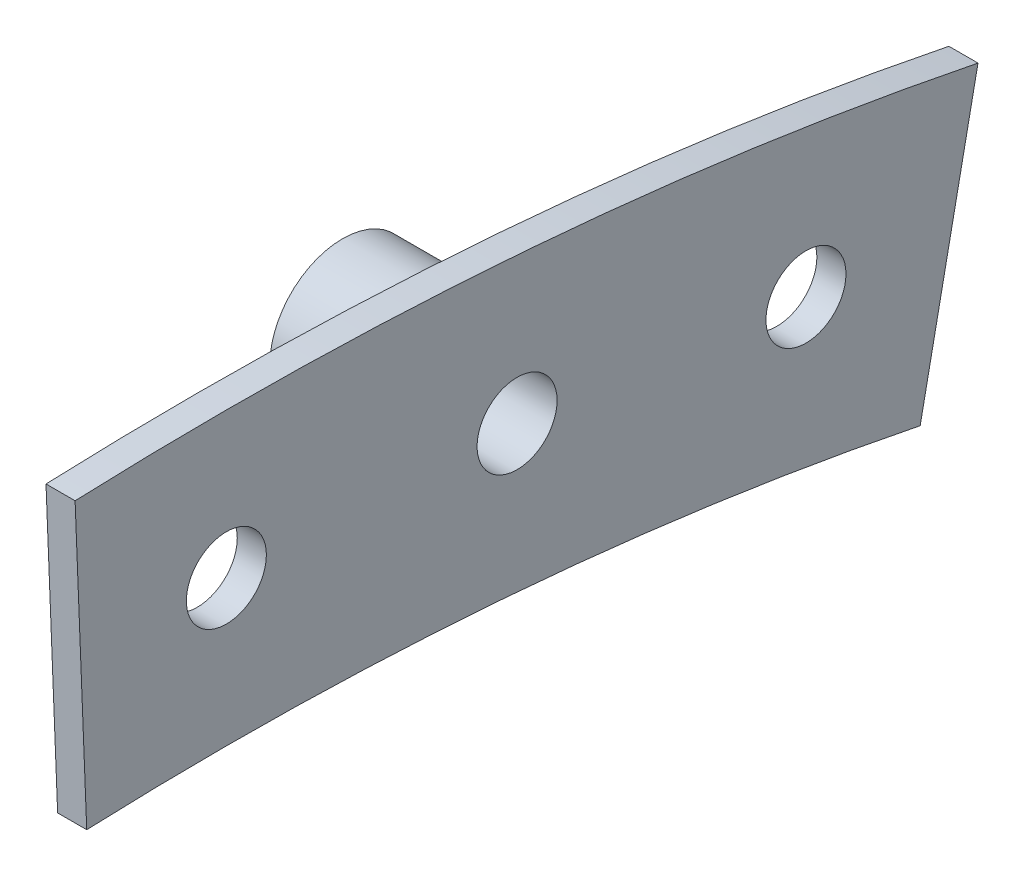
ISO-10303-21;
HEADER;
FILE_DESCRIPTION(('STEP AP214'),'2;1');
FILE_NAME('part.step','',(''),(''),'','','');
FILE_SCHEMA(('AUTOMOTIVE_DESIGN { 1 0 10303 214 1 1 1 1 }'));
ENDSEC;
DATA;
#1=APPLICATION_CONTEXT('core data for automotive mechanical design processes');
#2=APPLICATION_PROTOCOL_DEFINITION('international standard','automotive_design',2000,#1);
#3=PRODUCT_CONTEXT('',#1,'mechanical');
#4=PRODUCT('Part','Part','',(#3));
#5=PRODUCT_RELATED_PRODUCT_CATEGORY('part','',(#4));
#6=PRODUCT_DEFINITION_FORMATION('','',#4);
#7=PRODUCT_DEFINITION_CONTEXT('part definition',#1,'design');
#8=PRODUCT_DEFINITION('design','',#6,#7);
#9=PRODUCT_DEFINITION_SHAPE('','',#8);
#10=(LENGTH_UNIT() NAMED_UNIT(*) SI_UNIT(.MILLI.,.METRE.));
#11=(NAMED_UNIT(*) PLANE_ANGLE_UNIT() SI_UNIT($,.RADIAN.));
#12=(NAMED_UNIT(*) SI_UNIT($,.STERADIAN.) SOLID_ANGLE_UNIT());
#13=UNCERTAINTY_MEASURE_WITH_UNIT(LENGTH_MEASURE(1.E-05),#10,'distance_accuracy_value','');
#14=(GEOMETRIC_REPRESENTATION_CONTEXT(3) GLOBAL_UNCERTAINTY_ASSIGNED_CONTEXT((#13)) GLOBAL_UNIT_ASSIGNED_CONTEXT((#10,
#11,#12)) REPRESENTATION_CONTEXT('',''));
#15=CARTESIAN_POINT('',(0.,0.,0.));
#16=DIRECTION('',(0.,0.,1.));
#17=DIRECTION('',(1.,0.,0.));
#18=AXIS2_PLACEMENT_3D('',#15,#16,#17);
#19=CARTESIAN_POINT('',(2.54,0.,0.));
#20=DIRECTION('',(-1.,0.,0.));
#21=DIRECTION('',(0.,0.,1.));
#22=AXIS2_PLACEMENT_3D('',#19,#20,#21);
#23=CYLINDRICAL_SURFACE('',#22,330.2);
#24=CARTESIAN_POINT('',(0.,0.,0.));
#25=DIRECTION('',(1.,0.,0.));
#26=DIRECTION('',(0.,0.,-1.));
#27=AXIS2_PLACEMENT_3D('',#24,#25,#26);
#28=CIRCLE('',#27,330.2);
#29=CARTESIAN_POINT('',(0.,329.93584,13.2053581357871));
#30=VERTEX_POINT('',#29);
#31=CARTESIAN_POINT('',(0.,323.61500772706,-65.6152937493609));
#32=VERTEX_POINT('',#31);
#33=EDGE_CURVE('E129',#30,#32,#28,.F.);
#34=ORIENTED_EDGE('',*,*,#33,.F.);
#35=DIRECTION('',(-1.,0.,0.));
#36=VECTOR('',#35,1.);
#37=CARTESIAN_POINT('',(2.54,329.93584,13.2053581357871));
#38=LINE('',#37,#36);
#39=CARTESIAN_POINT('',(2.54,329.93584,13.2053581357871));
#40=VERTEX_POINT('',#39);
#41=EDGE_CURVE('E53',#40,#30,#38,.T.);
#42=ORIENTED_EDGE('',*,*,#41,.F.);
#43=CARTESIAN_POINT('',(2.54,0.,0.));
#44=DIRECTION('',(1.,0.,0.));
#45=DIRECTION('',(0.,0.,-1.));
#46=AXIS2_PLACEMENT_3D('',#43,#44,#45);
#47=CIRCLE('',#46,330.2);
#48=CARTESIAN_POINT('',(2.54,323.61500772706,-65.6152937493609));
#49=VERTEX_POINT('',#48);
#50=EDGE_CURVE('E111',#40,#49,#47,.F.);
#51=ORIENTED_EDGE('',*,*,#50,.T.);
#52=DIRECTION('',(-1.,0.,0.));
#53=VECTOR('',#52,1.);
#54=CARTESIAN_POINT('',(2.54,323.61500772706,-65.6152937493609));
#55=LINE('',#54,#53);
#56=EDGE_CURVE('E85',#49,#32,#55,.T.);
#57=ORIENTED_EDGE('',*,*,#56,.T.);
#58=EDGE_LOOP('',(#34,#42,#51,#57));
#59=FACE_BOUND('',#58,.T.);
#60=ADVANCED_FACE('F43',(#59),#23,.T.);
#61=CARTESIAN_POINT('',(2.54,0.,0.));
#62=DIRECTION('',(0.,-0.0399919991998399,0.9992));
#63=DIRECTION('',(0.,-0.9992,-0.0399919991998399));
#64=AXIS2_PLACEMENT_3D('',#61,#62,#63);
#65=PLANE('',#64);
#66=DIRECTION('',(0.,0.9992,0.0399919991998399));
#67=VECTOR('',#66,1.);
#68=CARTESIAN_POINT('',(0.,0.,0.));
#69=LINE('',#68,#67);
#70=CARTESIAN_POINT('',(0.,304.55616,12.1895613561112));
#71=VERTEX_POINT('',#70);
#72=EDGE_CURVE('E98',#71,#30,#69,.T.);
#73=ORIENTED_EDGE('',*,*,#72,.F.);
#74=DIRECTION('',(-1.,0.,0.));
#75=VECTOR('',#74,1.);
#76=CARTESIAN_POINT('',(2.54,304.55616,12.1895613561112));
#77=LINE('',#76,#75);
#78=CARTESIAN_POINT('',(2.54,304.55616,12.1895613561112));
#79=VERTEX_POINT('',#78);
#80=EDGE_CURVE('E92',#79,#71,#77,.T.);
#81=ORIENTED_EDGE('',*,*,#80,.F.);
#82=DIRECTION('',(0.,0.9992,0.0399919991998399));
#83=VECTOR('',#82,1.);
#84=CARTESIAN_POINT('',(2.54,0.,0.));
#85=LINE('',#84,#83);
#86=EDGE_CURVE('E96',#79,#40,#85,.T.);
#87=ORIENTED_EDGE('',*,*,#86,.T.);
#88=ORIENTED_EDGE('',*,*,#41,.T.);
#89=EDGE_LOOP('',(#73,#81,#87,#88));
#90=FACE_BOUND('',#89,.T.);
#91=ADVANCED_FACE('F94',(#90),#65,.T.);
#92=CARTESIAN_POINT('',(2.54,0.,0.));
#93=DIRECTION('',(-1.,0.,0.));
#94=DIRECTION('',(0.,0.,1.));
#95=AXIS2_PLACEMENT_3D('',#92,#93,#94);
#96=CYLINDRICAL_SURFACE('',#95,304.8);
#97=CARTESIAN_POINT('',(0.,0.,0.));
#98=DIRECTION('',(1.,0.,0.));
#99=DIRECTION('',(0.,0.,-1.));
#100=AXIS2_PLACEMENT_3D('',#97,#98,#99);
#101=CIRCLE('',#100,304.8);
#102=CARTESIAN_POINT('',(0.,298.721545594209,-60.5679634609485));
#103=VERTEX_POINT('',#102);
#104=EDGE_CURVE('E135',#71,#103,#101,.F.);
#105=ORIENTED_EDGE('',*,*,#104,.T.);
#106=DIRECTION('',(-1.,0.,0.));
#107=VECTOR('',#106,1.);
#108=CARTESIAN_POINT('',(2.54,298.721545594209,-60.5679634609485));
#109=LINE('',#108,#107);
#110=CARTESIAN_POINT('',(2.54,298.721545594209,-60.5679634609485));
#111=VERTEX_POINT('',#110);
#112=EDGE_CURVE('E102',#111,#103,#109,.T.);
#113=ORIENTED_EDGE('',*,*,#112,.F.);
#114=CARTESIAN_POINT('',(2.54,0.,0.));
#115=DIRECTION('',(1.,0.,0.));
#116=DIRECTION('',(0.,0.,-1.));
#117=AXIS2_PLACEMENT_3D('',#114,#115,#116);
#118=CIRCLE('',#117,304.8);
#119=EDGE_CURVE('E105',#79,#111,#118,.F.);
#120=ORIENTED_EDGE('',*,*,#119,.F.);
#121=ORIENTED_EDGE('',*,*,#80,.T.);
#122=EDGE_LOOP('',(#105,#113,#120,#121));
#123=FACE_BOUND('',#122,.T.);
#124=ADVANCED_FACE('F106',(#123),#96,.F.);
#125=CARTESIAN_POINT('',(2.54,0.,0.));
#126=DIRECTION('',(0.,0.198713790882377,0.980057564285463));
#127=DIRECTION('',(0.,-0.980057564285463,0.198713790882377));
#128=AXIS2_PLACEMENT_3D('',#125,#126,#127);
#129=PLANE('',#128);
#130=DIRECTION('',(0.,0.980057564285463,-0.198713790882377));
#131=VECTOR('',#130,1.);
#132=CARTESIAN_POINT('',(0.,0.,0.));
#133=LINE('',#132,#131);
#134=EDGE_CURVE('E78',#103,#32,#133,.T.);
#135=ORIENTED_EDGE('',*,*,#134,.T.);
#136=ORIENTED_EDGE('',*,*,#56,.F.);
#137=DIRECTION('',(0.,0.980057564285463,-0.198713790882377));
#138=VECTOR('',#137,1.);
#139=CARTESIAN_POINT('',(2.54,0.,0.));
#140=LINE('',#139,#138);
#141=EDGE_CURVE('E61',#111,#49,#140,.T.);
#142=ORIENTED_EDGE('',*,*,#141,.F.);
#143=ORIENTED_EDGE('',*,*,#112,.T.);
#144=EDGE_LOOP('',(#135,#136,#142,#143));
#145=FACE_BOUND('',#144,.T.);
#146=ADVANCED_FACE('F178',(#145),#129,.F.);
#147=CARTESIAN_POINT('',(2.54,316.484,-25.379671865491));
#148=DIRECTION('',(-1.,0.,0.));
#149=DIRECTION('',(0.,0.,1.));
#150=AXIS2_PLACEMENT_3D('',#147,#148,#149);
#151=CYLINDRICAL_SURFACE('',#150,3.4925);
#152=CARTESIAN_POINT('',(2.54,316.484,-25.379671865491));
#153=DIRECTION('',(1.,0.,0.));
#154=DIRECTION('',(0.,0.,-1.));
#155=AXIS2_PLACEMENT_3D('',#152,#153,#154);
#156=CIRCLE('',#155,3.4925);
#157=CARTESIAN_POINT('',(2.54,316.484,-28.872171865491));
#158=VERTEX_POINT('',#157);
#159=EDGE_CURVE('E115',#158,#158,#156,.T.);
#160=ORIENTED_EDGE('',*,*,#159,.T.);
#161=EDGE_LOOP('',(#160));
#162=FACE_BOUND('',#161,.T.);
#163=CARTESIAN_POINT('',(-6.35,316.484,-25.379671865491));
#164=DIRECTION('',(1.,0.,0.));
#165=DIRECTION('',(0.,0.,-1.));
#166=AXIS2_PLACEMENT_3D('',#163,#164,#165);
#167=CIRCLE('',#166,3.4925);
#168=CARTESIAN_POINT('',(-6.35,316.484,-28.872171865491));
#169=VERTEX_POINT('',#168);
#170=EDGE_CURVE('E189',#169,#169,#167,.T.);
#171=ORIENTED_EDGE('',*,*,#170,.F.);
#172=EDGE_LOOP('',(#171));
#173=FACE_BOUND('',#172,.T.);
#174=ADVANCED_FACE('F167',(#162,#173),#151,.F.);
#175=CARTESIAN_POINT('',(2.54,313.4425024,-50.5969138310429));
#176=DIRECTION('',(-1.,0.,0.));
#177=DIRECTION('',(0.,0.,1.));
#178=AXIS2_PLACEMENT_3D('',#175,#176,#177);
#179=CYLINDRICAL_SURFACE('',#178,3.49250000000001);
#180=CARTESIAN_POINT('',(2.54,313.4425024,-50.5969138310429));
#181=DIRECTION('',(1.,0.,0.));
#182=DIRECTION('',(0.,0.,-1.));
#183=AXIS2_PLACEMENT_3D('',#180,#181,#182);
#184=CIRCLE('',#183,3.49250000000001);
#185=CARTESIAN_POINT('',(2.54,313.4425024,-54.089413831043));
#186=VERTEX_POINT('',#185);
#187=EDGE_CURVE('E144',#186,#186,#184,.T.);
#188=ORIENTED_EDGE('',*,*,#187,.T.);
#189=EDGE_LOOP('',(#188));
#190=FACE_BOUND('',#189,.T.);
#191=CARTESIAN_POINT('',(0.,313.4425024,-50.5969138310429));
#192=DIRECTION('',(1.,0.,0.));
#193=DIRECTION('',(0.,0.,-1.));
#194=AXIS2_PLACEMENT_3D('',#191,#192,#193);
#195=CIRCLE('',#194,3.49250000000001);
#196=CARTESIAN_POINT('',(0.,313.4425024,-54.089413831043));
#197=VERTEX_POINT('',#196);
#198=EDGE_CURVE('E125',#197,#197,#195,.T.);
#199=ORIENTED_EDGE('',*,*,#198,.F.);
#200=EDGE_LOOP('',(#199));
#201=FACE_BOUND('',#200,.T.);
#202=ADVANCED_FACE('F45',(#190,#201),#179,.F.);
#203=CARTESIAN_POINT('',(2.54,317.5,0.));
#204=DIRECTION('',(-1.,0.,0.));
#205=DIRECTION('',(0.,0.,1.));
#206=AXIS2_PLACEMENT_3D('',#203,#204,#205);
#207=CYLINDRICAL_SURFACE('',#206,3.49250000000001);
#208=CARTESIAN_POINT('',(2.54,317.5,0.));
#209=DIRECTION('',(1.,0.,0.));
#210=DIRECTION('',(0.,0.,-1.));
#211=AXIS2_PLACEMENT_3D('',#208,#209,#210);
#212=CIRCLE('',#211,3.49250000000001);
#213=CARTESIAN_POINT('',(2.54,317.5,-3.49250000000001));
#214=VERTEX_POINT('',#213);
#215=EDGE_CURVE('E121',#214,#214,#212,.T.);
#216=ORIENTED_EDGE('',*,*,#215,.T.);
#217=EDGE_LOOP('',(#216));
#218=FACE_BOUND('',#217,.T.);
#219=CARTESIAN_POINT('',(0.,317.5,0.));
#220=DIRECTION('',(1.,0.,0.));
#221=DIRECTION('',(0.,0.,-1.));
#222=AXIS2_PLACEMENT_3D('',#219,#220,#221);
#223=CIRCLE('',#222,3.49250000000001);
#224=CARTESIAN_POINT('',(0.,317.5,-3.49250000000001));
#225=VERTEX_POINT('',#224);
#226=EDGE_CURVE('E140',#225,#225,#223,.T.);
#227=ORIENTED_EDGE('',*,*,#226,.F.);
#228=EDGE_LOOP('',(#227));
#229=FACE_BOUND('',#228,.T.);
#230=ADVANCED_FACE('F157',(#218,#229),#207,.F.);
#231=CARTESIAN_POINT('',(2.54,0.,0.));
#232=DIRECTION('',(1.,0.,0.));
#233=DIRECTION('',(0.,0.,-1.));
#234=AXIS2_PLACEMENT_3D('',#231,#232,#233);
#235=PLANE('',#234);
#236=ORIENTED_EDGE('',*,*,#187,.F.);
#237=EDGE_LOOP('',(#236));
#238=FACE_BOUND('',#237,.T.);
#239=ORIENTED_EDGE('',*,*,#159,.F.);
#240=EDGE_LOOP('',(#239));
#241=FACE_BOUND('',#240,.T.);
#242=ORIENTED_EDGE('',*,*,#50,.F.);
#243=ORIENTED_EDGE('',*,*,#86,.F.);
#244=ORIENTED_EDGE('',*,*,#119,.T.);
#245=ORIENTED_EDGE('',*,*,#141,.T.);
#246=EDGE_LOOP('',(#242,#243,#244,#245));
#247=FACE_BOUND('',#246,.T.);
#248=ORIENTED_EDGE('',*,*,#215,.F.);
#249=EDGE_LOOP('',(#248));
#250=FACE_BOUND('',#249,.T.);
#251=ADVANCED_FACE('F109',(#238,#241,#247,#250),#235,.T.);
#252=CARTESIAN_POINT('',(0.,0.,0.));
#253=DIRECTION('',(1.,0.,0.));
#254=DIRECTION('',(0.,0.,-1.));
#255=AXIS2_PLACEMENT_3D('',#252,#253,#254);
#256=PLANE('',#255);
#257=CARTESIAN_POINT('',(0.,316.484,-25.379671865491));
#258=DIRECTION('',(1.,0.,0.));
#259=DIRECTION('',(0.,0.,-1.));
#260=AXIS2_PLACEMENT_3D('',#257,#258,#259);
#261=CIRCLE('',#260,6.35);
#262=CARTESIAN_POINT('',(0.,316.484,-31.729671865491));
#263=VERTEX_POINT('',#262);
#264=EDGE_CURVE('E11',#263,#263,#261,.F.);
#265=ORIENTED_EDGE('',*,*,#264,.F.);
#266=EDGE_LOOP('',(#265));
#267=FACE_BOUND('',#266,.T.);
#268=ORIENTED_EDGE('',*,*,#198,.T.);
#269=EDGE_LOOP('',(#268));
#270=FACE_BOUND('',#269,.T.);
#271=ORIENTED_EDGE('',*,*,#33,.T.);
#272=ORIENTED_EDGE('',*,*,#134,.F.);
#273=ORIENTED_EDGE('',*,*,#104,.F.);
#274=ORIENTED_EDGE('',*,*,#72,.T.);
#275=EDGE_LOOP('',(#271,#272,#273,#274));
#276=FACE_BOUND('',#275,.T.);
#277=ORIENTED_EDGE('',*,*,#226,.T.);
#278=EDGE_LOOP('',(#277));
#279=FACE_BOUND('',#278,.T.);
#280=ADVANCED_FACE('F149',(#267,#270,#276,#279),#256,.F.);
#281=CARTESIAN_POINT('',(-12.7,316.484,-25.379671865491));
#282=DIRECTION('',(-1.,0.,0.));
#283=DIRECTION('',(0.,0.,1.));
#284=AXIS2_PLACEMENT_3D('',#281,#282,#283);
#285=PLANE('',#284);
#286=CARTESIAN_POINT('',(-12.7,316.484,-25.379671865491));
#287=DIRECTION('',(-1.,0.,0.));
#288=DIRECTION('',(0.,0.,1.));
#289=AXIS2_PLACEMENT_3D('',#286,#287,#288);
#290=CIRCLE('',#289,6.35);
#291=CARTESIAN_POINT('',(-12.7,316.484,-19.029671865491));
#292=VERTEX_POINT('',#291);
#293=EDGE_CURVE('E130',#292,#292,#290,.T.);
#294=ORIENTED_EDGE('',*,*,#293,.T.);
#295=EDGE_LOOP('',(#294));
#296=FACE_BOUND('',#295,.T.);
#297=ADVANCED_FACE('F152',(#296),#285,.T.);
#298=CARTESIAN_POINT('',(-12.7,316.484,-25.379671865491));
#299=DIRECTION('',(1.,0.,0.));
#300=DIRECTION('',(0.,0.,-1.));
#301=AXIS2_PLACEMENT_3D('',#298,#299,#300);
#302=CYLINDRICAL_SURFACE('',#301,6.35);
#303=ORIENTED_EDGE('',*,*,#293,.F.);
#304=EDGE_LOOP('',(#303));
#305=FACE_BOUND('',#304,.T.);
#306=ORIENTED_EDGE('',*,*,#264,.T.);
#307=EDGE_LOOP('',(#306));
#308=FACE_BOUND('',#307,.T.);
#309=ADVANCED_FACE('F208',(#305,#308),#302,.T.);
#310=CARTESIAN_POINT('',(-6.35,316.484,-25.379671865491));
#311=DIRECTION('',(1.,0.,0.));
#312=DIRECTION('',(0.,0.,-1.));
#313=AXIS2_PLACEMENT_3D('',#310,#311,#312);
#314=PLANE('',#313);
#315=ORIENTED_EDGE('',*,*,#170,.T.);
#316=EDGE_LOOP('',(#315));
#317=FACE_BOUND('',#316,.T.);
#318=ADVANCED_FACE('F211',(#317),#314,.T.);
#319=CLOSED_SHELL('',(#60,#91,#124,#146,#174,#202,#230,#251,#280,#297,#309,#318));
#320=MANIFOLD_SOLID_BREP('B2',#319);
#321=ADVANCED_BREP_SHAPE_REPRESENTATION('',(#18,#320),#14);
#322=SHAPE_DEFINITION_REPRESENTATION(#9,#321);
ENDSEC;
END-ISO-10303-21;
